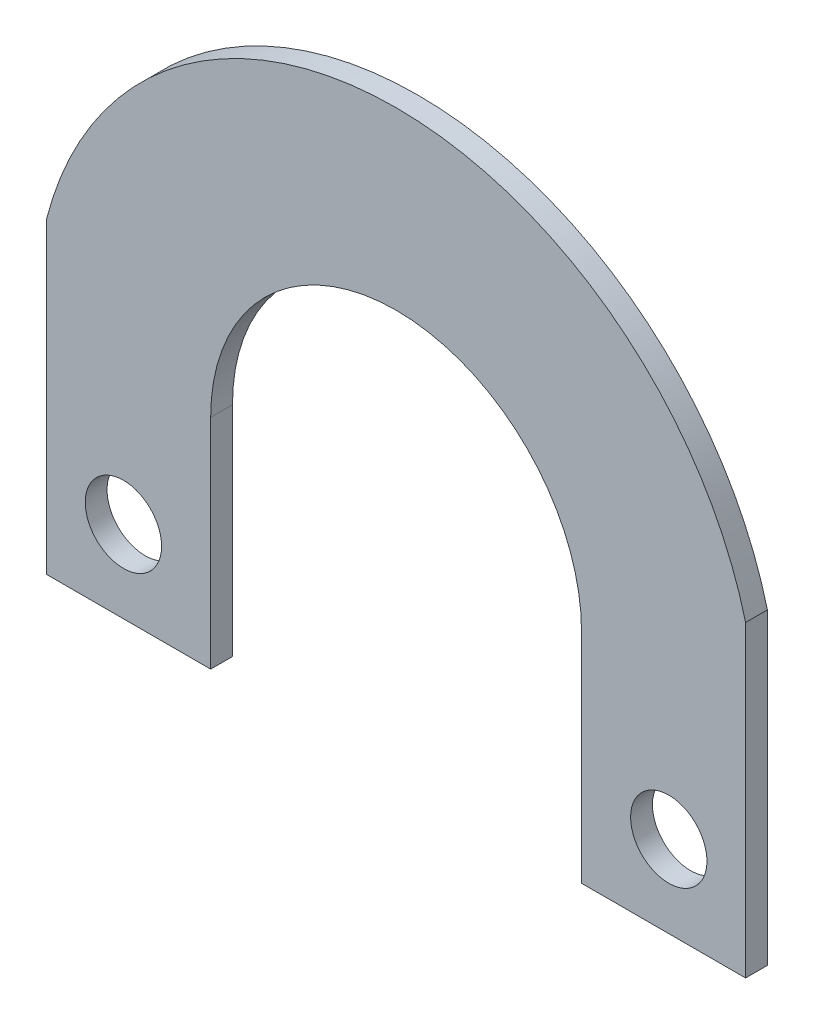
ISO-10303-21;
HEADER;
FILE_DESCRIPTION(('STEP AP214'),'2;1');
FILE_NAME('part.step','',(''),(''),'','','');
FILE_SCHEMA(('AUTOMOTIVE_DESIGN { 1 0 10303 214 1 1 1 1 }'));
ENDSEC;
DATA;
#1=APPLICATION_CONTEXT('core data for automotive mechanical design processes');
#2=APPLICATION_PROTOCOL_DEFINITION('international standard','automotive_design',2000,#1);
#3=PRODUCT_CONTEXT('',#1,'mechanical');
#4=PRODUCT('Part','Part','',(#3));
#5=PRODUCT_RELATED_PRODUCT_CATEGORY('part','',(#4));
#6=PRODUCT_DEFINITION_FORMATION('','',#4);
#7=PRODUCT_DEFINITION_CONTEXT('part definition',#1,'design');
#8=PRODUCT_DEFINITION('design','',#6,#7);
#9=PRODUCT_DEFINITION_SHAPE('','',#8);
#10=(LENGTH_UNIT() NAMED_UNIT(*) SI_UNIT(.MILLI.,.METRE.));
#11=(NAMED_UNIT(*) PLANE_ANGLE_UNIT() SI_UNIT($,.RADIAN.));
#12=(NAMED_UNIT(*) SI_UNIT($,.STERADIAN.) SOLID_ANGLE_UNIT());
#13=UNCERTAINTY_MEASURE_WITH_UNIT(LENGTH_MEASURE(1.E-05),#10,'distance_accuracy_value','');
#14=(GEOMETRIC_REPRESENTATION_CONTEXT(3) GLOBAL_UNCERTAINTY_ASSIGNED_CONTEXT((#13)) GLOBAL_UNIT_ASSIGNED_CONTEXT((#10,
#11,#12)) REPRESENTATION_CONTEXT('',''));
#15=CARTESIAN_POINT('',(0.,0.,0.));
#16=DIRECTION('',(0.,0.,1.));
#17=DIRECTION('',(1.,0.,0.));
#18=AXIS2_PLACEMENT_3D('',#15,#16,#17);
#19=CARTESIAN_POINT('',(-4.72264707330552E-13,2.12061271320785E-11,2.));
#20=DIRECTION('',(0.,0.,1.));
#21=DIRECTION('',(1.,0.,0.));
#22=AXIS2_PLACEMENT_3D('',#19,#20,#21);
#23=PLANE('',#22);
#24=CARTESIAN_POINT('',(-25.,-12.5,2.));
#25=DIRECTION('',(0.,0.,1.));
#26=DIRECTION('',(1.,0.,0.));
#27=AXIS2_PLACEMENT_3D('',#24,#25,#26);
#28=CIRCLE('',#27,3.5);
#29=CARTESIAN_POINT('',(-21.5,-12.5,2.));
#30=VERTEX_POINT('',#29);
#31=EDGE_CURVE('E139',#30,#30,#28,.T.);
#32=ORIENTED_EDGE('',*,*,#31,.F.);
#33=EDGE_LOOP('',(#32));
#34=FACE_BOUND('',#33,.T.);
#35=DIRECTION('',(1.,0.,0.));
#36=VECTOR('',#35,1.);
#37=CARTESIAN_POINT('',(-16.9999999999995,-19.9999999999993,2.));
#38=LINE('',#37,#36);
#39=CARTESIAN_POINT('',(-32.0429399400243,-19.9999999999993,2.));
#40=VERTEX_POINT('',#39);
#41=CARTESIAN_POINT('',(-16.9999999999995,-19.9999999999993,2.));
#42=VERTEX_POINT('',#41);
#43=EDGE_CURVE('E52',#40,#42,#38,.T.);
#44=ORIENTED_EDGE('',*,*,#43,.T.);
#45=DIRECTION('',(0.,1.,0.));
#46=VECTOR('',#45,1.);
#47=CARTESIAN_POINT('',(-16.9999999999995,2.12040452325199E-11,2.));
#48=LINE('',#47,#46);
#49=CARTESIAN_POINT('',(-17.,2.1208209031637E-11,2.));
#50=VERTEX_POINT('',#49);
#51=EDGE_CURVE('E96',#42,#50,#48,.T.);
#52=ORIENTED_EDGE('',*,*,#51,.T.);
#53=CARTESIAN_POINT('',(-4.72264707330552E-13,2.12061271320785E-11,2.));
#54=DIRECTION('',(0.,0.,-1.));
#55=DIRECTION('',(1.,0.,0.));
#56=AXIS2_PLACEMENT_3D('',#53,#54,#55);
#57=CIRCLE('',#56,16.9999999999995);
#58=CARTESIAN_POINT('',(16.9999999999995,2.1208209031637E-11,2.));
#59=VERTEX_POINT('',#58);
#60=EDGE_CURVE('E165',#50,#59,#57,.T.);
#61=ORIENTED_EDGE('',*,*,#60,.T.);
#62=DIRECTION('',(0.,-1.,0.));
#63=VECTOR('',#62,1.);
#64=CARTESIAN_POINT('',(16.9999999999995,2.1208209031637E-11,2.));
#65=LINE('',#64,#63);
#66=CARTESIAN_POINT('',(16.9999999999995,-19.9999999999993,2.));
#67=VERTEX_POINT('',#66);
#68=EDGE_CURVE('E178',#59,#67,#65,.T.);
#69=ORIENTED_EDGE('',*,*,#68,.T.);
#70=DIRECTION('',(1.,0.,0.));
#71=VECTOR('',#70,1.);
#72=CARTESIAN_POINT('',(16.9999999999995,-19.9999999999993,2.));
#73=LINE('',#72,#71);
#74=CARTESIAN_POINT('',(32.0429399400243,-19.9999999999993,2.));
#75=VERTEX_POINT('',#74);
#76=EDGE_CURVE('E116',#67,#75,#73,.T.);
#77=ORIENTED_EDGE('',*,*,#76,.T.);
#78=DIRECTION('',(0.,1.,0.));
#79=VECTOR('',#78,1.);
#80=CARTESIAN_POINT('',(32.0429399400243,-19.9999999999993,2.));
#81=LINE('',#80,#79);
#82=CARTESIAN_POINT('',(32.0429399400238,8.22806497301202,2.));
#83=VERTEX_POINT('',#82);
#84=EDGE_CURVE('E110',#75,#83,#81,.T.);
#85=ORIENTED_EDGE('',*,*,#84,.T.);
#86=CARTESIAN_POINT('',(-4.72264707330552E-13,2.12061271320785E-11,2.));
#87=DIRECTION('',(0.,0.,1.));
#88=DIRECTION('',(1.,0.,0.));
#89=AXIS2_PLACEMENT_3D('',#86,#87,#88);
#90=CIRCLE('',#89,33.0824886185994);
#91=CARTESIAN_POINT('',(-32.0429399400243,8.22806497301134,2.));
#92=VERTEX_POINT('',#91);
#93=EDGE_CURVE('E114',#83,#92,#90,.T.);
#94=ORIENTED_EDGE('',*,*,#93,.T.);
#95=DIRECTION('',(0.,-1.,0.));
#96=VECTOR('',#95,1.);
#97=CARTESIAN_POINT('',(-32.0429399400243,-19.9999999999993,2.));
#98=LINE('',#97,#96);
#99=EDGE_CURVE('E130',#92,#40,#98,.T.);
#100=ORIENTED_EDGE('',*,*,#99,.T.);
#101=EDGE_LOOP('',(#44,#52,#61,#69,#77,#85,#94,#100));
#102=FACE_BOUND('',#101,.T.);
#103=CARTESIAN_POINT('',(25.,-12.5,2.));
#104=DIRECTION('',(0.,0.,1.));
#105=DIRECTION('',(-1.,0.,0.));
#106=AXIS2_PLACEMENT_3D('',#103,#104,#105);
#107=CIRCLE('',#106,3.5);
#108=CARTESIAN_POINT('',(21.5,-12.5,2.));
#109=VERTEX_POINT('',#108);
#110=EDGE_CURVE('E187',#109,#109,#107,.T.);
#111=ORIENTED_EDGE('',*,*,#110,.F.);
#112=EDGE_LOOP('',(#111));
#113=FACE_BOUND('',#112,.T.);
#114=ADVANCED_FACE('F35',(#34,#102,#113),#23,.T.);
#115=CARTESIAN_POINT('',(-4.72264707330552E-13,2.12061271320785E-11,0.));
#116=DIRECTION('',(0.,0.,1.));
#117=DIRECTION('',(1.,0.,0.));
#118=AXIS2_PLACEMENT_3D('',#115,#116,#117);
#119=PLANE('',#118);
#120=DIRECTION('',(0.,1.,0.));
#121=VECTOR('',#120,1.);
#122=CARTESIAN_POINT('',(-16.9999999999995,2.12040452325199E-11,0.));
#123=LINE('',#122,#121);
#124=CARTESIAN_POINT('',(-16.9999999999995,-19.9999999999993,0.));
#125=VERTEX_POINT('',#124);
#126=CARTESIAN_POINT('',(-17.,2.1208209031637E-11,0.));
#127=VERTEX_POINT('',#126);
#128=EDGE_CURVE('E136',#125,#127,#123,.T.);
#129=ORIENTED_EDGE('',*,*,#128,.F.);
#130=DIRECTION('',(1.,0.,0.));
#131=VECTOR('',#130,1.);
#132=CARTESIAN_POINT('',(-17.5000000000009,-19.9999999999993,0.));
#133=LINE('',#132,#131);
#134=CARTESIAN_POINT('',(-32.0429399400243,-19.9999999999993,0.));
#135=VERTEX_POINT('',#134);
#136=EDGE_CURVE('E149',#135,#125,#133,.T.);
#137=ORIENTED_EDGE('',*,*,#136,.F.);
#138=DIRECTION('',(0.,-1.,0.));
#139=VECTOR('',#138,1.);
#140=CARTESIAN_POINT('',(-32.0429399400243,-19.9999999999993,0.));
#141=LINE('',#140,#139);
#142=CARTESIAN_POINT('',(-32.0429399400243,8.22806497301134,0.));
#143=VERTEX_POINT('',#142);
#144=EDGE_CURVE('E89',#143,#135,#141,.T.);
#145=ORIENTED_EDGE('',*,*,#144,.F.);
#146=CARTESIAN_POINT('',(-4.72264707330552E-13,2.12061271320785E-11,0.));
#147=DIRECTION('',(0.,0.,1.));
#148=DIRECTION('',(1.,0.,0.));
#149=AXIS2_PLACEMENT_3D('',#146,#147,#148);
#150=CIRCLE('',#149,33.0824886185994);
#151=CARTESIAN_POINT('',(32.0429399400238,8.22806497301202,0.));
#152=VERTEX_POINT('',#151);
#153=EDGE_CURVE('E82',#152,#143,#150,.T.);
#154=ORIENTED_EDGE('',*,*,#153,.F.);
#155=DIRECTION('',(0.,1.,0.));
#156=VECTOR('',#155,1.);
#157=CARTESIAN_POINT('',(32.0429399400243,-19.9999999999993,0.));
#158=LINE('',#157,#156);
#159=CARTESIAN_POINT('',(32.0429399400243,-19.9999999999993,0.));
#160=VERTEX_POINT('',#159);
#161=EDGE_CURVE('E124',#160,#152,#158,.T.);
#162=ORIENTED_EDGE('',*,*,#161,.F.);
#163=DIRECTION('',(1.,0.,0.));
#164=VECTOR('',#163,1.);
#165=CARTESIAN_POINT('',(17.4999999999991,-19.9999999999993,0.));
#166=LINE('',#165,#164);
#167=CARTESIAN_POINT('',(16.9999999999995,-19.9999999999993,0.));
#168=VERTEX_POINT('',#167);
#169=EDGE_CURVE('E144',#168,#160,#166,.T.);
#170=ORIENTED_EDGE('',*,*,#169,.F.);
#171=DIRECTION('',(0.,-1.,0.));
#172=VECTOR('',#171,1.);
#173=CARTESIAN_POINT('',(16.9999999999995,2.1208209031637E-11,0.));
#174=LINE('',#173,#172);
#175=CARTESIAN_POINT('',(16.9999999999995,2.1208209031637E-11,0.));
#176=VERTEX_POINT('',#175);
#177=EDGE_CURVE('E141',#176,#168,#174,.T.);
#178=ORIENTED_EDGE('',*,*,#177,.F.);
#179=CARTESIAN_POINT('',(-4.72264707330552E-13,2.12061271320785E-11,0.));
#180=DIRECTION('',(0.,0.,-1.));
#181=DIRECTION('',(1.,0.,0.));
#182=AXIS2_PLACEMENT_3D('',#179,#180,#181);
#183=CIRCLE('',#182,16.9999999999995);
#184=EDGE_CURVE('E138',#127,#176,#183,.T.);
#185=ORIENTED_EDGE('',*,*,#184,.F.);
#186=EDGE_LOOP('',(#129,#137,#145,#154,#162,#170,#178,#185));
#187=FACE_BOUND('',#186,.T.);
#188=CARTESIAN_POINT('',(-25.,-12.5,0.));
#189=DIRECTION('',(0.,0.,1.));
#190=DIRECTION('',(1.,0.,0.));
#191=AXIS2_PLACEMENT_3D('',#188,#189,#190);
#192=CIRCLE('',#191,3.5);
#193=CARTESIAN_POINT('',(-21.5,-12.5,0.));
#194=VERTEX_POINT('',#193);
#195=EDGE_CURVE('E184',#194,#194,#192,.T.);
#196=ORIENTED_EDGE('',*,*,#195,.T.);
#197=EDGE_LOOP('',(#196));
#198=FACE_BOUND('',#197,.T.);
#199=CARTESIAN_POINT('',(25.,-12.5,0.));
#200=DIRECTION('',(0.,0.,1.));
#201=DIRECTION('',(-1.,0.,0.));
#202=AXIS2_PLACEMENT_3D('',#199,#200,#201);
#203=CIRCLE('',#202,3.5);
#204=CARTESIAN_POINT('',(21.5,-12.5,0.));
#205=VERTEX_POINT('',#204);
#206=EDGE_CURVE('E190',#205,#205,#203,.T.);
#207=ORIENTED_EDGE('',*,*,#206,.T.);
#208=EDGE_LOOP('',(#207));
#209=FACE_BOUND('',#208,.T.);
#210=ADVANCED_FACE('F169',(#187,#198,#209),#119,.F.);
#211=CARTESIAN_POINT('',(-16.9999999999995,2.12040452325199E-11,2.));
#212=DIRECTION('',(-1.,0.,0.));
#213=DIRECTION('',(0.,-1.,0.));
#214=AXIS2_PLACEMENT_3D('',#211,#212,#213);
#215=PLANE('',#214);
#216=ORIENTED_EDGE('',*,*,#128,.T.);
#217=DIRECTION('',(0.,0.,-1.));
#218=VECTOR('',#217,1.);
#219=CARTESIAN_POINT('',(-17.,2.1208209031637E-11,2.));
#220=LINE('',#219,#218);
#221=EDGE_CURVE('E44',#50,#127,#220,.T.);
#222=ORIENTED_EDGE('',*,*,#221,.F.);
#223=ORIENTED_EDGE('',*,*,#51,.F.);
#224=DIRECTION('',(0.,0.,-1.));
#225=VECTOR('',#224,1.);
#226=CARTESIAN_POINT('',(-16.9999999999995,-19.9999999999993,2.));
#227=LINE('',#226,#225);
#228=EDGE_CURVE('E11',#42,#125,#227,.T.);
#229=ORIENTED_EDGE('',*,*,#228,.T.);
#230=EDGE_LOOP('',(#216,#222,#223,#229));
#231=FACE_BOUND('',#230,.T.);
#232=ADVANCED_FACE('F37',(#231),#215,.F.);
#233=CARTESIAN_POINT('',(-4.72264707330552E-13,2.12061271320785E-11,2.));
#234=DIRECTION('',(0.,0.,-1.));
#235=DIRECTION('',(-1.,0.,0.));
#236=AXIS2_PLACEMENT_3D('',#233,#234,#235);
#237=CYLINDRICAL_SURFACE('',#236,16.9999999999995);
#238=ORIENTED_EDGE('',*,*,#184,.T.);
#239=DIRECTION('',(0.,0.,-1.));
#240=VECTOR('',#239,1.);
#241=CARTESIAN_POINT('',(16.9999999999995,2.1208209031637E-11,2.));
#242=LINE('',#241,#240);
#243=EDGE_CURVE('E157',#59,#176,#242,.T.);
#244=ORIENTED_EDGE('',*,*,#243,.F.);
#245=ORIENTED_EDGE('',*,*,#60,.F.);
#246=ORIENTED_EDGE('',*,*,#221,.T.);
#247=EDGE_LOOP('',(#238,#244,#245,#246));
#248=FACE_BOUND('',#247,.T.);
#249=ADVANCED_FACE('F163',(#248),#237,.F.);
#250=CARTESIAN_POINT('',(16.9999999999995,2.1208209031637E-11,2.));
#251=DIRECTION('',(1.,0.,0.));
#252=DIRECTION('',(0.,1.,0.));
#253=AXIS2_PLACEMENT_3D('',#250,#251,#252);
#254=PLANE('',#253);
#255=ORIENTED_EDGE('',*,*,#177,.T.);
#256=DIRECTION('',(0.,0.,-1.));
#257=VECTOR('',#256,1.);
#258=CARTESIAN_POINT('',(16.9999999999995,-19.9999999999993,2.));
#259=LINE('',#258,#257);
#260=EDGE_CURVE('E154',#67,#168,#259,.T.);
#261=ORIENTED_EDGE('',*,*,#260,.F.);
#262=ORIENTED_EDGE('',*,*,#68,.F.);
#263=ORIENTED_EDGE('',*,*,#243,.T.);
#264=EDGE_LOOP('',(#255,#261,#262,#263));
#265=FACE_BOUND('',#264,.T.);
#266=ADVANCED_FACE('F174',(#265),#254,.F.);
#267=CARTESIAN_POINT('',(17.4999999999991,-19.9999999999993,2.));
#268=DIRECTION('',(0.,1.,0.));
#269=DIRECTION('',(-1.,0.,0.));
#270=AXIS2_PLACEMENT_3D('',#267,#268,#269);
#271=PLANE('',#270);
#272=ORIENTED_EDGE('',*,*,#169,.T.);
#273=DIRECTION('',(0.,0.,-1.));
#274=VECTOR('',#273,1.);
#275=CARTESIAN_POINT('',(32.0429399400243,-19.9999999999993,2.));
#276=LINE('',#275,#274);
#277=EDGE_CURVE('E125',#75,#160,#276,.T.);
#278=ORIENTED_EDGE('',*,*,#277,.F.);
#279=ORIENTED_EDGE('',*,*,#76,.F.);
#280=ORIENTED_EDGE('',*,*,#260,.T.);
#281=EDGE_LOOP('',(#272,#278,#279,#280));
#282=FACE_BOUND('',#281,.T.);
#283=ADVANCED_FACE('F177',(#282),#271,.F.);
#284=CARTESIAN_POINT('',(32.0429399400243,-19.9999999999993,2.));
#285=DIRECTION('',(-1.,0.,0.));
#286=DIRECTION('',(0.,-1.,0.));
#287=AXIS2_PLACEMENT_3D('',#284,#285,#286);
#288=PLANE('',#287);
#289=ORIENTED_EDGE('',*,*,#161,.T.);
#290=DIRECTION('',(0.,0.,-1.));
#291=VECTOR('',#290,1.);
#292=CARTESIAN_POINT('',(32.0429399400238,8.22806497301202,2.));
#293=LINE('',#292,#291);
#294=EDGE_CURVE('E121',#83,#152,#293,.T.);
#295=ORIENTED_EDGE('',*,*,#294,.F.);
#296=ORIENTED_EDGE('',*,*,#84,.F.);
#297=ORIENTED_EDGE('',*,*,#277,.T.);
#298=EDGE_LOOP('',(#289,#295,#296,#297));
#299=FACE_BOUND('',#298,.T.);
#300=ADVANCED_FACE('F122',(#299),#288,.F.);
#301=CARTESIAN_POINT('',(-4.72264707330552E-13,2.12061271320785E-11,2.));
#302=DIRECTION('',(0.,0.,-1.));
#303=DIRECTION('',(-1.,0.,0.));
#304=AXIS2_PLACEMENT_3D('',#301,#302,#303);
#305=CYLINDRICAL_SURFACE('',#304,33.0824886185994);
#306=ORIENTED_EDGE('',*,*,#153,.T.);
#307=DIRECTION('',(0.,0.,-1.));
#308=VECTOR('',#307,1.);
#309=CARTESIAN_POINT('',(-32.0429399400243,8.22806497301134,2.));
#310=LINE('',#309,#308);
#311=EDGE_CURVE('E126',#92,#143,#310,.T.);
#312=ORIENTED_EDGE('',*,*,#311,.F.);
#313=ORIENTED_EDGE('',*,*,#93,.F.);
#314=ORIENTED_EDGE('',*,*,#294,.T.);
#315=EDGE_LOOP('',(#306,#312,#313,#314));
#316=FACE_BOUND('',#315,.T.);
#317=ADVANCED_FACE('F128',(#316),#305,.T.);
#318=CARTESIAN_POINT('',(-32.0429399400243,-19.9999999999993,2.));
#319=DIRECTION('',(1.,0.,0.));
#320=DIRECTION('',(0.,0.,-1.));
#321=AXIS2_PLACEMENT_3D('',#318,#319,#320);
#322=PLANE('',#321);
#323=ORIENTED_EDGE('',*,*,#144,.T.);
#324=DIRECTION('',(0.,0.,-1.));
#325=VECTOR('',#324,1.);
#326=CARTESIAN_POINT('',(-32.0429399400243,-19.9999999999993,2.));
#327=LINE('',#326,#325);
#328=EDGE_CURVE('E132',#40,#135,#327,.T.);
#329=ORIENTED_EDGE('',*,*,#328,.F.);
#330=ORIENTED_EDGE('',*,*,#99,.F.);
#331=ORIENTED_EDGE('',*,*,#311,.T.);
#332=EDGE_LOOP('',(#323,#329,#330,#331));
#333=FACE_BOUND('',#332,.T.);
#334=ADVANCED_FACE('F213',(#333),#322,.F.);
#335=CARTESIAN_POINT('',(-17.5000000000009,-19.9999999999993,2.));
#336=DIRECTION('',(0.,1.,0.));
#337=DIRECTION('',(-1.,0.,0.));
#338=AXIS2_PLACEMENT_3D('',#335,#336,#337);
#339=PLANE('',#338);
#340=ORIENTED_EDGE('',*,*,#136,.T.);
#341=ORIENTED_EDGE('',*,*,#228,.F.);
#342=ORIENTED_EDGE('',*,*,#43,.F.);
#343=ORIENTED_EDGE('',*,*,#328,.T.);
#344=EDGE_LOOP('',(#340,#341,#342,#343));
#345=FACE_BOUND('',#344,.T.);
#346=ADVANCED_FACE('F210',(#345),#339,.F.);
#347=CARTESIAN_POINT('',(-25.,-12.5,2.));
#348=DIRECTION('',(0.,0.,-1.));
#349=DIRECTION('',(-1.,0.,0.));
#350=AXIS2_PLACEMENT_3D('',#347,#348,#349);
#351=CYLINDRICAL_SURFACE('',#350,3.5);
#352=ORIENTED_EDGE('',*,*,#31,.T.);
#353=EDGE_LOOP('',(#352));
#354=FACE_BOUND('',#353,.T.);
#355=ORIENTED_EDGE('',*,*,#195,.F.);
#356=EDGE_LOOP('',(#355));
#357=FACE_BOUND('',#356,.T.);
#358=ADVANCED_FACE('F207',(#354,#357),#351,.F.);
#359=CARTESIAN_POINT('',(25.,-12.5,2.));
#360=DIRECTION('',(0.,0.,-1.));
#361=DIRECTION('',(-1.,0.,0.));
#362=AXIS2_PLACEMENT_3D('',#359,#360,#361);
#363=CYLINDRICAL_SURFACE('',#362,3.5);
#364=ORIENTED_EDGE('',*,*,#110,.T.);
#365=EDGE_LOOP('',(#364));
#366=FACE_BOUND('',#365,.T.);
#367=ORIENTED_EDGE('',*,*,#206,.F.);
#368=EDGE_LOOP('',(#367));
#369=FACE_BOUND('',#368,.T.);
#370=ADVANCED_FACE('F196',(#366,#369),#363,.F.);
#371=CLOSED_SHELL('',(#114,#210,#232,#249,#266,#283,#300,#317,#334,#346,#358,#370));
#372=MANIFOLD_SOLID_BREP('B2',#371);
#373=ADVANCED_BREP_SHAPE_REPRESENTATION('',(#18,#372),#14);
#374=SHAPE_DEFINITION_REPRESENTATION(#9,#373);
ENDSEC;
END-ISO-10303-21;
